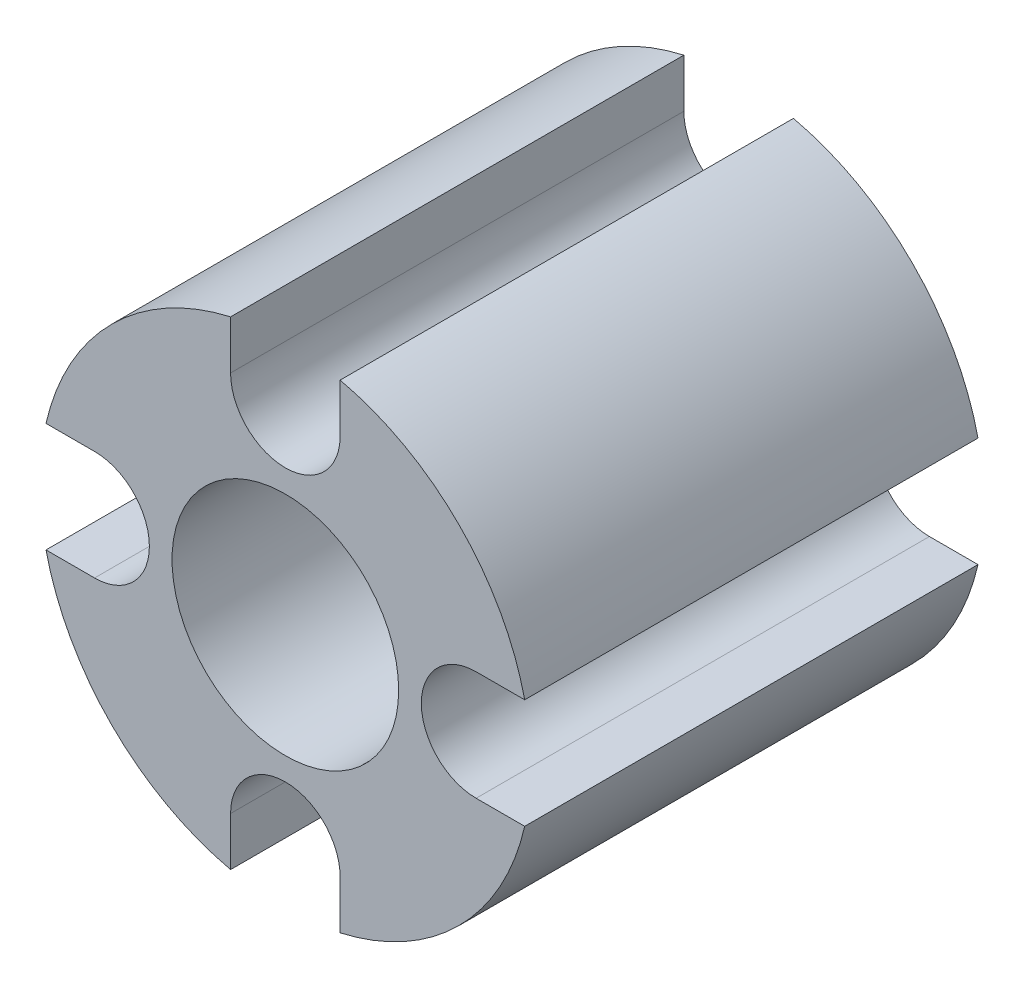
ISO-10303-21;
HEADER;
FILE_DESCRIPTION(('STEP AP214'),'2;1');
FILE_NAME('part.step','',(''),(''),'','','');
FILE_SCHEMA(('AUTOMOTIVE_DESIGN { 1 0 10303 214 1 1 1 1 }'));
ENDSEC;
DATA;
#1=APPLICATION_CONTEXT('core data for automotive mechanical design processes');
#2=APPLICATION_PROTOCOL_DEFINITION('international standard','automotive_design',2000,#1);
#3=PRODUCT_CONTEXT('',#1,'mechanical');
#4=PRODUCT('Part','Part','',(#3));
#5=PRODUCT_RELATED_PRODUCT_CATEGORY('part','',(#4));
#6=PRODUCT_DEFINITION_FORMATION('','',#4);
#7=PRODUCT_DEFINITION_CONTEXT('part definition',#1,'design');
#8=PRODUCT_DEFINITION('design','',#6,#7);
#9=PRODUCT_DEFINITION_SHAPE('','',#8);
#10=(LENGTH_UNIT() NAMED_UNIT(*) SI_UNIT(.MILLI.,.METRE.));
#11=(NAMED_UNIT(*) PLANE_ANGLE_UNIT() SI_UNIT($,.RADIAN.));
#12=(NAMED_UNIT(*) SI_UNIT($,.STERADIAN.) SOLID_ANGLE_UNIT());
#13=UNCERTAINTY_MEASURE_WITH_UNIT(LENGTH_MEASURE(1.E-05),#10,'distance_accuracy_value','');
#14=(GEOMETRIC_REPRESENTATION_CONTEXT(3) GLOBAL_UNCERTAINTY_ASSIGNED_CONTEXT((#13)) GLOBAL_UNIT_ASSIGNED_CONTEXT((#10,
#11,#12)) REPRESENTATION_CONTEXT('',''));
#15=CARTESIAN_POINT('',(0.,0.,0.));
#16=DIRECTION('',(0.,0.,1.));
#17=DIRECTION('',(1.,0.,0.));
#18=AXIS2_PLACEMENT_3D('',#15,#16,#17);
#19=CARTESIAN_POINT('',(0.,2.525,6.));
#20=DIRECTION('',(0.,0.,1.));
#21=DIRECTION('',(1.,0.,0.));
#22=AXIS2_PLACEMENT_3D('',#19,#20,#21);
#23=PLANE('',#22);
#24=CARTESIAN_POINT('',(0.,2.525,6.));
#25=DIRECTION('',(0.,0.,-1.));
#26=DIRECTION('',(1.,0.,0.));
#27=AXIS2_PLACEMENT_3D('',#24,#25,#26);
#28=CIRCLE('',#27,0.725);
#29=CARTESIAN_POINT('',(0.725,2.525,6.));
#30=VERTEX_POINT('',#29);
#31=CARTESIAN_POINT('',(-0.725,2.525,6.));
#32=VERTEX_POINT('',#31);
#33=EDGE_CURVE('E209',#30,#32,#28,.T.);
#34=ORIENTED_EDGE('',*,*,#33,.T.);
#35=DIRECTION('',(0.,1.,0.));
#36=VECTOR('',#35,1.);
#37=CARTESIAN_POINT('',(-0.725,2.525,6.));
#38=LINE('',#37,#36);
#39=CARTESIAN_POINT('',(-0.724999999999996,3.16810274454598,6.));
#40=VERTEX_POINT('',#39);
#41=EDGE_CURVE('E117',#32,#40,#38,.T.);
#42=ORIENTED_EDGE('',*,*,#41,.T.);
#43=CARTESIAN_POINT('',(0.,0.,6.));
#44=DIRECTION('',(0.,0.,1.));
#45=DIRECTION('',(1.,0.,0.));
#46=AXIS2_PLACEMENT_3D('',#43,#44,#45);
#47=CIRCLE('',#46,3.24999999999997);
#48=CARTESIAN_POINT('',(-3.16810274454595,0.724999999999984,6.));
#49=VERTEX_POINT('',#48);
#50=EDGE_CURVE('E248',#40,#49,#47,.T.);
#51=ORIENTED_EDGE('',*,*,#50,.T.);
#52=DIRECTION('',(1.,0.,0.));
#53=VECTOR('',#52,1.);
#54=CARTESIAN_POINT('',(-2.525,0.724999999999996,6.));
#55=LINE('',#54,#53);
#56=CARTESIAN_POINT('',(-2.525,0.725,6.));
#57=VERTEX_POINT('',#56);
#58=EDGE_CURVE('E267',#49,#57,#55,.T.);
#59=ORIENTED_EDGE('',*,*,#58,.T.);
#60=CARTESIAN_POINT('',(-2.525,0.,6.));
#61=DIRECTION('',(0.,0.,-1.));
#62=DIRECTION('',(1.,0.,0.));
#63=AXIS2_PLACEMENT_3D('',#60,#61,#62);
#64=CIRCLE('',#63,0.725);
#65=CARTESIAN_POINT('',(-2.525,-0.725000000000004,6.));
#66=VERTEX_POINT('',#65);
#67=EDGE_CURVE('E264',#57,#66,#64,.T.);
#68=ORIENTED_EDGE('',*,*,#67,.T.);
#69=DIRECTION('',(-1.,0.,0.));
#70=VECTOR('',#69,1.);
#71=CARTESIAN_POINT('',(-2.525,-0.725000000000004,6.));
#72=LINE('',#71,#70);
#73=CARTESIAN_POINT('',(-3.16810274454602,-0.724999999999966,6.));
#74=VERTEX_POINT('',#73);
#75=EDGE_CURVE('E266',#66,#74,#72,.T.);
#76=ORIENTED_EDGE('',*,*,#75,.T.);
#77=CARTESIAN_POINT('',(0.,0.,6.));
#78=DIRECTION('',(0.,0.,1.));
#79=DIRECTION('',(1.,0.,0.));
#80=AXIS2_PLACEMENT_3D('',#77,#78,#79);
#81=CIRCLE('',#80,3.25);
#82=CARTESIAN_POINT('',(-0.724999999999996,-3.16810274454602,6.));
#83=VERTEX_POINT('',#82);
#84=EDGE_CURVE('E269',#74,#83,#81,.T.);
#85=ORIENTED_EDGE('',*,*,#84,.T.);
#86=DIRECTION('',(0.,1.,0.));
#87=VECTOR('',#86,1.);
#88=CARTESIAN_POINT('',(-0.724999999999996,-2.525,6.));
#89=LINE('',#88,#87);
#90=CARTESIAN_POINT('',(-0.724999999999996,-2.525,6.));
#91=VERTEX_POINT('',#90);
#92=EDGE_CURVE('E275',#83,#91,#89,.T.);
#93=ORIENTED_EDGE('',*,*,#92,.T.);
#94=CARTESIAN_POINT('',(0.,-2.525,6.));
#95=DIRECTION('',(0.,0.,-1.));
#96=DIRECTION('',(1.,0.,0.));
#97=AXIS2_PLACEMENT_3D('',#94,#95,#96);
#98=CIRCLE('',#97,0.725);
#99=CARTESIAN_POINT('',(0.725000000000004,-2.525,6.));
#100=VERTEX_POINT('',#99);
#101=EDGE_CURVE('E277',#91,#100,#98,.T.);
#102=ORIENTED_EDGE('',*,*,#101,.T.);
#103=DIRECTION('',(0.,-1.,0.));
#104=VECTOR('',#103,1.);
#105=CARTESIAN_POINT('',(0.725000000000004,-2.525,6.));
#106=LINE('',#105,#104);
#107=CARTESIAN_POINT('',(0.725000000000004,-3.16810274454602,6.));
#108=VERTEX_POINT('',#107);
#109=EDGE_CURVE('E279',#100,#108,#106,.T.);
#110=ORIENTED_EDGE('',*,*,#109,.T.);
#111=CARTESIAN_POINT('',(0.,0.,6.));
#112=DIRECTION('',(0.,0.,1.));
#113=DIRECTION('',(1.,0.,0.));
#114=AXIS2_PLACEMENT_3D('',#111,#112,#113);
#115=CIRCLE('',#114,3.25);
#116=CARTESIAN_POINT('',(3.16810274454602,-0.724999999999996,6.));
#117=VERTEX_POINT('',#116);
#118=EDGE_CURVE('E281',#108,#117,#115,.T.);
#119=ORIENTED_EDGE('',*,*,#118,.T.);
#120=DIRECTION('',(-1.,0.,0.));
#121=VECTOR('',#120,1.);
#122=CARTESIAN_POINT('',(2.525,-0.724999999999996,6.));
#123=LINE('',#122,#121);
#124=CARTESIAN_POINT('',(2.525,-0.724999999999996,6.));
#125=VERTEX_POINT('',#124);
#126=EDGE_CURVE('E283',#117,#125,#123,.T.);
#127=ORIENTED_EDGE('',*,*,#126,.T.);
#128=CARTESIAN_POINT('',(2.525,0.,6.));
#129=DIRECTION('',(0.,0.,-1.));
#130=DIRECTION('',(1.,0.,0.));
#131=AXIS2_PLACEMENT_3D('',#128,#129,#130);
#132=CIRCLE('',#131,0.725);
#133=CARTESIAN_POINT('',(2.525,0.725000000000003,6.));
#134=VERTEX_POINT('',#133);
#135=EDGE_CURVE('E160',#125,#134,#132,.T.);
#136=ORIENTED_EDGE('',*,*,#135,.T.);
#137=DIRECTION('',(1.,0.,0.));
#138=VECTOR('',#137,1.);
#139=CARTESIAN_POINT('',(2.525,0.725000000000003,6.));
#140=LINE('',#139,#138);
#141=CARTESIAN_POINT('',(3.16810274454601,0.725000000000004,6.));
#142=VERTEX_POINT('',#141);
#143=EDGE_CURVE('E154',#134,#142,#140,.T.);
#144=ORIENTED_EDGE('',*,*,#143,.T.);
#145=CARTESIAN_POINT('',(0.,0.,6.));
#146=DIRECTION('',(0.,0.,1.));
#147=DIRECTION('',(1.,0.,0.));
#148=AXIS2_PLACEMENT_3D('',#145,#146,#147);
#149=CIRCLE('',#148,3.25);
#150=CARTESIAN_POINT('',(0.725,3.16810274454602,6.));
#151=VERTEX_POINT('',#150);
#152=EDGE_CURVE('E158',#142,#151,#149,.T.);
#153=ORIENTED_EDGE('',*,*,#152,.T.);
#154=DIRECTION('',(0.,-1.,0.));
#155=VECTOR('',#154,1.);
#156=CARTESIAN_POINT('',(0.725,2.525,6.));
#157=LINE('',#156,#155);
#158=EDGE_CURVE('E50',#151,#30,#157,.T.);
#159=ORIENTED_EDGE('',*,*,#158,.T.);
#160=EDGE_LOOP('',(#34,#42,#51,#59,#68,#76,#85,#93,#102,#110,#119,#127,#136,#144,#153,#159));
#161=FACE_BOUND('',#160,.T.);
#162=CARTESIAN_POINT('',(0.,0.,6.));
#163=DIRECTION('',(0.,0.,1.));
#164=DIRECTION('',(1.,0.,0.));
#165=AXIS2_PLACEMENT_3D('',#162,#163,#164);
#166=CIRCLE('',#165,1.5);
#167=CARTESIAN_POINT('',(1.5,0.,6.));
#168=VERTEX_POINT('',#167);
#169=EDGE_CURVE('E182',#168,#168,#166,.T.);
#170=ORIENTED_EDGE('',*,*,#169,.F.);
#171=EDGE_LOOP('',(#170));
#172=FACE_BOUND('',#171,.T.);
#173=ADVANCED_FACE('F33',(#161,#172),#23,.T.);
#174=CARTESIAN_POINT('',(0.,2.525,0.));
#175=DIRECTION('',(0.,0.,1.));
#176=DIRECTION('',(1.,0.,0.));
#177=AXIS2_PLACEMENT_3D('',#174,#175,#176);
#178=PLANE('',#177);
#179=CARTESIAN_POINT('',(0.,2.525,0.));
#180=DIRECTION('',(0.,0.,-1.));
#181=DIRECTION('',(1.,0.,0.));
#182=AXIS2_PLACEMENT_3D('',#179,#180,#181);
#183=CIRCLE('',#182,0.725);
#184=CARTESIAN_POINT('',(0.725,2.525,0.));
#185=VERTEX_POINT('',#184);
#186=CARTESIAN_POINT('',(-0.725,2.525,0.));
#187=VERTEX_POINT('',#186);
#188=EDGE_CURVE('E178',#185,#187,#183,.T.);
#189=ORIENTED_EDGE('',*,*,#188,.F.);
#190=DIRECTION('',(0.,-1.,0.));
#191=VECTOR('',#190,1.);
#192=CARTESIAN_POINT('',(0.725,2.525,0.));
#193=LINE('',#192,#191);
#194=CARTESIAN_POINT('',(0.725,3.16810274454602,0.));
#195=VERTEX_POINT('',#194);
#196=EDGE_CURVE('E109',#195,#185,#193,.T.);
#197=ORIENTED_EDGE('',*,*,#196,.F.);
#198=CARTESIAN_POINT('',(0.,0.,0.));
#199=DIRECTION('',(0.,0.,1.));
#200=DIRECTION('',(1.,0.,0.));
#201=AXIS2_PLACEMENT_3D('',#198,#199,#200);
#202=CIRCLE('',#201,3.25);
#203=CARTESIAN_POINT('',(3.16810274454601,0.725000000000004,0.));
#204=VERTEX_POINT('',#203);
#205=EDGE_CURVE('E103',#204,#195,#202,.T.);
#206=ORIENTED_EDGE('',*,*,#205,.F.);
#207=DIRECTION('',(1.,0.,0.));
#208=VECTOR('',#207,1.);
#209=CARTESIAN_POINT('',(2.525,0.725000000000003,0.));
#210=LINE('',#209,#208);
#211=CARTESIAN_POINT('',(2.525,0.725000000000003,0.));
#212=VERTEX_POINT('',#211);
#213=EDGE_CURVE('E168',#212,#204,#210,.T.);
#214=ORIENTED_EDGE('',*,*,#213,.F.);
#215=CARTESIAN_POINT('',(2.525,0.,0.));
#216=DIRECTION('',(0.,0.,-1.));
#217=DIRECTION('',(1.,0.,0.));
#218=AXIS2_PLACEMENT_3D('',#215,#216,#217);
#219=CIRCLE('',#218,0.725);
#220=CARTESIAN_POINT('',(2.525,-0.724999999999996,0.));
#221=VERTEX_POINT('',#220);
#222=EDGE_CURVE('E204',#221,#212,#219,.T.);
#223=ORIENTED_EDGE('',*,*,#222,.F.);
#224=DIRECTION('',(-1.,0.,0.));
#225=VECTOR('',#224,1.);
#226=CARTESIAN_POINT('',(2.525,-0.724999999999996,0.));
#227=LINE('',#226,#225);
#228=CARTESIAN_POINT('',(3.16810274454602,-0.724999999999996,0.));
#229=VERTEX_POINT('',#228);
#230=EDGE_CURVE('E202',#229,#221,#227,.T.);
#231=ORIENTED_EDGE('',*,*,#230,.F.);
#232=CARTESIAN_POINT('',(0.,0.,0.));
#233=DIRECTION('',(0.,0.,1.));
#234=DIRECTION('',(1.,0.,0.));
#235=AXIS2_PLACEMENT_3D('',#232,#233,#234);
#236=CIRCLE('',#235,3.25);
#237=CARTESIAN_POINT('',(0.725000000000004,-3.16810274454602,0.));
#238=VERTEX_POINT('',#237);
#239=EDGE_CURVE('E200',#238,#229,#236,.T.);
#240=ORIENTED_EDGE('',*,*,#239,.F.);
#241=DIRECTION('',(0.,-1.,0.));
#242=VECTOR('',#241,1.);
#243=CARTESIAN_POINT('',(0.725000000000004,-2.525,0.));
#244=LINE('',#243,#242);
#245=CARTESIAN_POINT('',(0.725000000000004,-2.525,0.));
#246=VERTEX_POINT('',#245);
#247=EDGE_CURVE('E198',#246,#238,#244,.T.);
#248=ORIENTED_EDGE('',*,*,#247,.F.);
#249=CARTESIAN_POINT('',(0.,-2.525,0.));
#250=DIRECTION('',(0.,0.,-1.));
#251=DIRECTION('',(1.,0.,0.));
#252=AXIS2_PLACEMENT_3D('',#249,#250,#251);
#253=CIRCLE('',#252,0.725);
#254=CARTESIAN_POINT('',(-0.724999999999996,-2.525,0.));
#255=VERTEX_POINT('',#254);
#256=EDGE_CURVE('E196',#255,#246,#253,.T.);
#257=ORIENTED_EDGE('',*,*,#256,.F.);
#258=DIRECTION('',(0.,1.,0.));
#259=VECTOR('',#258,1.);
#260=CARTESIAN_POINT('',(-0.724999999999996,-2.525,0.));
#261=LINE('',#260,#259);
#262=CARTESIAN_POINT('',(-0.724999999999996,-3.16810274454602,0.));
#263=VERTEX_POINT('',#262);
#264=EDGE_CURVE('E194',#263,#255,#261,.T.);
#265=ORIENTED_EDGE('',*,*,#264,.F.);
#266=CARTESIAN_POINT('',(0.,0.,0.));
#267=DIRECTION('',(0.,0.,1.));
#268=DIRECTION('',(1.,0.,0.));
#269=AXIS2_PLACEMENT_3D('',#266,#267,#268);
#270=CIRCLE('',#269,3.25);
#271=CARTESIAN_POINT('',(-3.16810274454602,-0.724999999999966,0.));
#272=VERTEX_POINT('',#271);
#273=EDGE_CURVE('E192',#272,#263,#270,.T.);
#274=ORIENTED_EDGE('',*,*,#273,.F.);
#275=DIRECTION('',(-1.,0.,0.));
#276=VECTOR('',#275,1.);
#277=CARTESIAN_POINT('',(-2.525,-0.725000000000004,0.));
#278=LINE('',#277,#276);
#279=CARTESIAN_POINT('',(-2.525,-0.725000000000004,0.));
#280=VERTEX_POINT('',#279);
#281=EDGE_CURVE('E190',#280,#272,#278,.T.);
#282=ORIENTED_EDGE('',*,*,#281,.F.);
#283=CARTESIAN_POINT('',(-2.525,0.,0.));
#284=DIRECTION('',(0.,0.,-1.));
#285=DIRECTION('',(1.,0.,0.));
#286=AXIS2_PLACEMENT_3D('',#283,#284,#285);
#287=CIRCLE('',#286,0.725);
#288=CARTESIAN_POINT('',(-2.525,0.725,0.));
#289=VERTEX_POINT('',#288);
#290=EDGE_CURVE('E188',#289,#280,#287,.T.);
#291=ORIENTED_EDGE('',*,*,#290,.F.);
#292=DIRECTION('',(1.,0.,0.));
#293=VECTOR('',#292,1.);
#294=CARTESIAN_POINT('',(-2.525,0.724999999999996,0.));
#295=LINE('',#294,#293);
#296=CARTESIAN_POINT('',(-3.16810274454595,0.724999999999984,0.));
#297=VERTEX_POINT('',#296);
#298=EDGE_CURVE('E186',#297,#289,#295,.T.);
#299=ORIENTED_EDGE('',*,*,#298,.F.);
#300=CARTESIAN_POINT('',(0.,0.,0.));
#301=DIRECTION('',(0.,0.,1.));
#302=DIRECTION('',(1.,0.,0.));
#303=AXIS2_PLACEMENT_3D('',#300,#301,#302);
#304=CIRCLE('',#303,3.24999999999997);
#305=CARTESIAN_POINT('',(-0.724999999999996,3.16810274454598,0.));
#306=VERTEX_POINT('',#305);
#307=EDGE_CURVE('E184',#306,#297,#304,.T.);
#308=ORIENTED_EDGE('',*,*,#307,.F.);
#309=DIRECTION('',(0.,1.,0.));
#310=VECTOR('',#309,1.);
#311=CARTESIAN_POINT('',(-0.725,2.525,0.));
#312=LINE('',#311,#310);
#313=EDGE_CURVE('E181',#187,#306,#312,.T.);
#314=ORIENTED_EDGE('',*,*,#313,.F.);
#315=EDGE_LOOP('',(#189,#197,#206,#214,#223,#231,#240,#248,#257,#265,#274,#282,#291,#299,#308,#314));
#316=FACE_BOUND('',#315,.T.);
#317=CARTESIAN_POINT('',(0.,0.,0.));
#318=DIRECTION('',(0.,0.,1.));
#319=DIRECTION('',(1.,0.,0.));
#320=AXIS2_PLACEMENT_3D('',#317,#318,#319);
#321=CIRCLE('',#320,1.5);
#322=CARTESIAN_POINT('',(1.5,0.,0.));
#323=VERTEX_POINT('',#322);
#324=EDGE_CURVE('E488',#323,#323,#321,.T.);
#325=ORIENTED_EDGE('',*,*,#324,.T.);
#326=EDGE_LOOP('',(#325));
#327=FACE_BOUND('',#326,.T.);
#328=ADVANCED_FACE('F252',(#316,#327),#178,.F.);
#329=CARTESIAN_POINT('',(0.,2.525,6.));
#330=DIRECTION('',(0.,0.,-1.));
#331=DIRECTION('',(-1.,0.,0.));
#332=AXIS2_PLACEMENT_3D('',#329,#330,#331);
#333=CYLINDRICAL_SURFACE('',#332,0.725);
#334=ORIENTED_EDGE('',*,*,#188,.T.);
#335=DIRECTION('',(0.,0.,-1.));
#336=VECTOR('',#335,1.);
#337=CARTESIAN_POINT('',(-0.725,2.525,6.));
#338=LINE('',#337,#336);
#339=EDGE_CURVE('E11',#32,#187,#338,.T.);
#340=ORIENTED_EDGE('',*,*,#339,.F.);
#341=ORIENTED_EDGE('',*,*,#33,.F.);
#342=DIRECTION('',(0.,0.,-1.));
#343=VECTOR('',#342,1.);
#344=CARTESIAN_POINT('',(0.725,2.525,6.));
#345=LINE('',#344,#343);
#346=EDGE_CURVE('E174',#30,#185,#345,.T.);
#347=ORIENTED_EDGE('',*,*,#346,.T.);
#348=EDGE_LOOP('',(#334,#340,#341,#347));
#349=FACE_BOUND('',#348,.T.);
#350=ADVANCED_FACE('F35',(#349),#333,.F.);
#351=CARTESIAN_POINT('',(-0.725,2.525,6.));
#352=DIRECTION('',(-1.,0.,0.));
#353=DIRECTION('',(0.,-1.,0.));
#354=AXIS2_PLACEMENT_3D('',#351,#352,#353);
#355=PLANE('',#354);
#356=ORIENTED_EDGE('',*,*,#313,.T.);
#357=DIRECTION('',(0.,0.,-1.));
#358=VECTOR('',#357,1.);
#359=CARTESIAN_POINT('',(-0.724999999999996,3.16810274454598,6.));
#360=LINE('',#359,#358);
#361=EDGE_CURVE('E42',#40,#306,#360,.T.);
#362=ORIENTED_EDGE('',*,*,#361,.F.);
#363=ORIENTED_EDGE('',*,*,#41,.F.);
#364=ORIENTED_EDGE('',*,*,#339,.T.);
#365=EDGE_LOOP('',(#356,#362,#363,#364));
#366=FACE_BOUND('',#365,.T.);
#367=ADVANCED_FACE('F317',(#366),#355,.F.);
#368=CARTESIAN_POINT('',(0.,0.,6.));
#369=DIRECTION('',(0.,0.,-1.));
#370=DIRECTION('',(-1.,0.,0.));
#371=AXIS2_PLACEMENT_3D('',#368,#369,#370);
#372=CYLINDRICAL_SURFACE('',#371,3.24999999999997);
#373=ORIENTED_EDGE('',*,*,#307,.T.);
#374=DIRECTION('',(0.,0.,-1.));
#375=VECTOR('',#374,1.);
#376=CARTESIAN_POINT('',(-3.16810274454595,0.724999999999984,6.));
#377=LINE('',#376,#375);
#378=EDGE_CURVE('E240',#49,#297,#377,.T.);
#379=ORIENTED_EDGE('',*,*,#378,.F.);
#380=ORIENTED_EDGE('',*,*,#50,.F.);
#381=ORIENTED_EDGE('',*,*,#361,.T.);
#382=EDGE_LOOP('',(#373,#379,#380,#381));
#383=FACE_BOUND('',#382,.T.);
#384=ADVANCED_FACE('F246',(#383),#372,.T.);
#385=CARTESIAN_POINT('',(-2.525,0.724999999999996,6.));
#386=DIRECTION('',(0.,1.,0.));
#387=DIRECTION('',(-1.,0.,0.));
#388=AXIS2_PLACEMENT_3D('',#385,#386,#387);
#389=PLANE('',#388);
#390=ORIENTED_EDGE('',*,*,#298,.T.);
#391=DIRECTION('',(0.,0.,-1.));
#392=VECTOR('',#391,1.);
#393=CARTESIAN_POINT('',(-2.525,0.725,6.));
#394=LINE('',#393,#392);
#395=EDGE_CURVE('E237',#57,#289,#394,.T.);
#396=ORIENTED_EDGE('',*,*,#395,.F.);
#397=ORIENTED_EDGE('',*,*,#58,.F.);
#398=ORIENTED_EDGE('',*,*,#378,.T.);
#399=EDGE_LOOP('',(#390,#396,#397,#398));
#400=FACE_BOUND('',#399,.T.);
#401=ADVANCED_FACE('F258',(#400),#389,.F.);
#402=CARTESIAN_POINT('',(-2.525,0.,6.));
#403=DIRECTION('',(0.,0.,-1.));
#404=DIRECTION('',(-1.,0.,0.));
#405=AXIS2_PLACEMENT_3D('',#402,#403,#404);
#406=CYLINDRICAL_SURFACE('',#405,0.725);
#407=ORIENTED_EDGE('',*,*,#290,.T.);
#408=DIRECTION('',(0.,0.,-1.));
#409=VECTOR('',#408,1.);
#410=CARTESIAN_POINT('',(-2.525,-0.725000000000004,6.));
#411=LINE('',#410,#409);
#412=EDGE_CURVE('E234',#66,#280,#411,.T.);
#413=ORIENTED_EDGE('',*,*,#412,.F.);
#414=ORIENTED_EDGE('',*,*,#67,.F.);
#415=ORIENTED_EDGE('',*,*,#395,.T.);
#416=EDGE_LOOP('',(#407,#413,#414,#415));
#417=FACE_BOUND('',#416,.T.);
#418=ADVANCED_FACE('F262',(#417),#406,.F.);
#419=CARTESIAN_POINT('',(-2.525,-0.725000000000004,6.));
#420=DIRECTION('',(0.,-1.,0.));
#421=DIRECTION('',(1.,0.,0.));
#422=AXIS2_PLACEMENT_3D('',#419,#420,#421);
#423=PLANE('',#422);
#424=ORIENTED_EDGE('',*,*,#281,.T.);
#425=DIRECTION('',(0.,0.,-1.));
#426=VECTOR('',#425,1.);
#427=CARTESIAN_POINT('',(-3.16810274454602,-0.724999999999966,6.));
#428=LINE('',#427,#426);
#429=EDGE_CURVE('E231',#74,#272,#428,.T.);
#430=ORIENTED_EDGE('',*,*,#429,.F.);
#431=ORIENTED_EDGE('',*,*,#75,.F.);
#432=ORIENTED_EDGE('',*,*,#412,.T.);
#433=EDGE_LOOP('',(#424,#430,#431,#432));
#434=FACE_BOUND('',#433,.T.);
#435=ADVANCED_FACE('F330',(#434),#423,.F.);
#436=CARTESIAN_POINT('',(0.,0.,6.));
#437=DIRECTION('',(0.,0.,-1.));
#438=DIRECTION('',(-1.,0.,0.));
#439=AXIS2_PLACEMENT_3D('',#436,#437,#438);
#440=CYLINDRICAL_SURFACE('',#439,3.25);
#441=ORIENTED_EDGE('',*,*,#273,.T.);
#442=DIRECTION('',(0.,0.,-1.));
#443=VECTOR('',#442,1.);
#444=CARTESIAN_POINT('',(-0.724999999999996,-3.16810274454602,6.));
#445=LINE('',#444,#443);
#446=EDGE_CURVE('E228',#83,#263,#445,.T.);
#447=ORIENTED_EDGE('',*,*,#446,.F.);
#448=ORIENTED_EDGE('',*,*,#84,.F.);
#449=ORIENTED_EDGE('',*,*,#429,.T.);
#450=EDGE_LOOP('',(#441,#447,#448,#449));
#451=FACE_BOUND('',#450,.T.);
#452=ADVANCED_FACE('F333',(#451),#440,.T.);
#453=CARTESIAN_POINT('',(-0.724999999999996,-2.525,6.));
#454=DIRECTION('',(-1.,0.,0.));
#455=DIRECTION('',(0.,-1.,0.));
#456=AXIS2_PLACEMENT_3D('',#453,#454,#455);
#457=PLANE('',#456);
#458=ORIENTED_EDGE('',*,*,#264,.T.);
#459=DIRECTION('',(0.,0.,-1.));
#460=VECTOR('',#459,1.);
#461=CARTESIAN_POINT('',(-0.724999999999996,-2.525,6.));
#462=LINE('',#461,#460);
#463=EDGE_CURVE('E225',#91,#255,#462,.T.);
#464=ORIENTED_EDGE('',*,*,#463,.F.);
#465=ORIENTED_EDGE('',*,*,#92,.F.);
#466=ORIENTED_EDGE('',*,*,#446,.T.);
#467=EDGE_LOOP('',(#458,#464,#465,#466));
#468=FACE_BOUND('',#467,.T.);
#469=ADVANCED_FACE('F337',(#468),#457,.F.);
#470=CARTESIAN_POINT('',(0.,-2.525,6.));
#471=DIRECTION('',(0.,0.,-1.));
#472=DIRECTION('',(-1.,0.,0.));
#473=AXIS2_PLACEMENT_3D('',#470,#471,#472);
#474=CYLINDRICAL_SURFACE('',#473,0.725);
#475=ORIENTED_EDGE('',*,*,#256,.T.);
#476=DIRECTION('',(0.,0.,-1.));
#477=VECTOR('',#476,1.);
#478=CARTESIAN_POINT('',(0.725000000000004,-2.525,6.));
#479=LINE('',#478,#477);
#480=EDGE_CURVE('E222',#100,#246,#479,.T.);
#481=ORIENTED_EDGE('',*,*,#480,.F.);
#482=ORIENTED_EDGE('',*,*,#101,.F.);
#483=ORIENTED_EDGE('',*,*,#463,.T.);
#484=EDGE_LOOP('',(#475,#481,#482,#483));
#485=FACE_BOUND('',#484,.T.);
#486=ADVANCED_FACE('F341',(#485),#474,.F.);
#487=CARTESIAN_POINT('',(0.725000000000004,-2.525,6.));
#488=DIRECTION('',(1.,0.,0.));
#489=DIRECTION('',(0.,1.,0.));
#490=AXIS2_PLACEMENT_3D('',#487,#488,#489);
#491=PLANE('',#490);
#492=ORIENTED_EDGE('',*,*,#247,.T.);
#493=DIRECTION('',(0.,0.,-1.));
#494=VECTOR('',#493,1.);
#495=CARTESIAN_POINT('',(0.725000000000004,-3.16810274454602,6.));
#496=LINE('',#495,#494);
#497=EDGE_CURVE('E219',#108,#238,#496,.T.);
#498=ORIENTED_EDGE('',*,*,#497,.F.);
#499=ORIENTED_EDGE('',*,*,#109,.F.);
#500=ORIENTED_EDGE('',*,*,#480,.T.);
#501=EDGE_LOOP('',(#492,#498,#499,#500));
#502=FACE_BOUND('',#501,.T.);
#503=ADVANCED_FACE('F345',(#502),#491,.F.);
#504=CARTESIAN_POINT('',(0.,0.,6.));
#505=DIRECTION('',(0.,0.,-1.));
#506=DIRECTION('',(-1.,0.,0.));
#507=AXIS2_PLACEMENT_3D('',#504,#505,#506);
#508=CYLINDRICAL_SURFACE('',#507,3.25);
#509=ORIENTED_EDGE('',*,*,#239,.T.);
#510=DIRECTION('',(0.,0.,-1.));
#511=VECTOR('',#510,1.);
#512=CARTESIAN_POINT('',(3.16810274454602,-0.724999999999996,6.));
#513=LINE('',#512,#511);
#514=EDGE_CURVE('E216',#117,#229,#513,.T.);
#515=ORIENTED_EDGE('',*,*,#514,.F.);
#516=ORIENTED_EDGE('',*,*,#118,.F.);
#517=ORIENTED_EDGE('',*,*,#497,.T.);
#518=EDGE_LOOP('',(#509,#515,#516,#517));
#519=FACE_BOUND('',#518,.T.);
#520=ADVANCED_FACE('F349',(#519),#508,.T.);
#521=CARTESIAN_POINT('',(2.525,-0.724999999999996,6.));
#522=DIRECTION('',(0.,-1.,0.));
#523=DIRECTION('',(1.,0.,0.));
#524=AXIS2_PLACEMENT_3D('',#521,#522,#523);
#525=PLANE('',#524);
#526=ORIENTED_EDGE('',*,*,#230,.T.);
#527=DIRECTION('',(0.,0.,-1.));
#528=VECTOR('',#527,1.);
#529=CARTESIAN_POINT('',(2.525,-0.724999999999996,6.));
#530=LINE('',#529,#528);
#531=EDGE_CURVE('E213',#125,#221,#530,.T.);
#532=ORIENTED_EDGE('',*,*,#531,.F.);
#533=ORIENTED_EDGE('',*,*,#126,.F.);
#534=ORIENTED_EDGE('',*,*,#514,.T.);
#535=EDGE_LOOP('',(#526,#532,#533,#534));
#536=FACE_BOUND('',#535,.T.);
#537=ADVANCED_FACE('F289',(#536),#525,.F.);
#538=CARTESIAN_POINT('',(2.525,0.,6.));
#539=DIRECTION('',(0.,0.,-1.));
#540=DIRECTION('',(-1.,0.,0.));
#541=AXIS2_PLACEMENT_3D('',#538,#539,#540);
#542=CYLINDRICAL_SURFACE('',#541,0.725);
#543=ORIENTED_EDGE('',*,*,#222,.T.);
#544=DIRECTION('',(0.,0.,-1.));
#545=VECTOR('',#544,1.);
#546=CARTESIAN_POINT('',(2.525,0.725000000000003,6.));
#547=LINE('',#546,#545);
#548=EDGE_CURVE('E169',#134,#212,#547,.T.);
#549=ORIENTED_EDGE('',*,*,#548,.F.);
#550=ORIENTED_EDGE('',*,*,#135,.F.);
#551=ORIENTED_EDGE('',*,*,#531,.T.);
#552=EDGE_LOOP('',(#543,#549,#550,#551));
#553=FACE_BOUND('',#552,.T.);
#554=ADVANCED_FACE('F293',(#553),#542,.F.);
#555=CARTESIAN_POINT('',(2.525,0.725000000000003,6.));
#556=DIRECTION('',(0.,1.,0.));
#557=DIRECTION('',(-1.,0.,0.));
#558=AXIS2_PLACEMENT_3D('',#555,#556,#557);
#559=PLANE('',#558);
#560=ORIENTED_EDGE('',*,*,#213,.T.);
#561=DIRECTION('',(0.,0.,-1.));
#562=VECTOR('',#561,1.);
#563=CARTESIAN_POINT('',(3.16810274454601,0.725000000000004,6.));
#564=LINE('',#563,#562);
#565=EDGE_CURVE('E165',#142,#204,#564,.T.);
#566=ORIENTED_EDGE('',*,*,#565,.F.);
#567=ORIENTED_EDGE('',*,*,#143,.F.);
#568=ORIENTED_EDGE('',*,*,#548,.T.);
#569=EDGE_LOOP('',(#560,#566,#567,#568));
#570=FACE_BOUND('',#569,.T.);
#571=ADVANCED_FACE('F166',(#570),#559,.F.);
#572=CARTESIAN_POINT('',(0.,0.,6.));
#573=DIRECTION('',(0.,0.,-1.));
#574=DIRECTION('',(-1.,0.,0.));
#575=AXIS2_PLACEMENT_3D('',#572,#573,#574);
#576=CYLINDRICAL_SURFACE('',#575,3.25);
#577=ORIENTED_EDGE('',*,*,#205,.T.);
#578=DIRECTION('',(0.,0.,-1.));
#579=VECTOR('',#578,1.);
#580=CARTESIAN_POINT('',(0.725,3.16810274454602,6.));
#581=LINE('',#580,#579);
#582=EDGE_CURVE('E170',#151,#195,#581,.T.);
#583=ORIENTED_EDGE('',*,*,#582,.F.);
#584=ORIENTED_EDGE('',*,*,#152,.F.);
#585=ORIENTED_EDGE('',*,*,#565,.T.);
#586=EDGE_LOOP('',(#577,#583,#584,#585));
#587=FACE_BOUND('',#586,.T.);
#588=ADVANCED_FACE('F172',(#587),#576,.T.);
#589=CARTESIAN_POINT('',(0.725,2.525,6.));
#590=DIRECTION('',(1.,0.,0.));
#591=DIRECTION('',(0.,1.,0.));
#592=AXIS2_PLACEMENT_3D('',#589,#590,#591);
#593=PLANE('',#592);
#594=ORIENTED_EDGE('',*,*,#196,.T.);
#595=ORIENTED_EDGE('',*,*,#346,.F.);
#596=ORIENTED_EDGE('',*,*,#158,.F.);
#597=ORIENTED_EDGE('',*,*,#582,.T.);
#598=EDGE_LOOP('',(#594,#595,#596,#597));
#599=FACE_BOUND('',#598,.T.);
#600=ADVANCED_FACE('F297',(#599),#593,.F.);
#601=CARTESIAN_POINT('',(0.,0.,6.));
#602=DIRECTION('',(0.,0.,-1.));
#603=DIRECTION('',(-1.,0.,0.));
#604=AXIS2_PLACEMENT_3D('',#601,#602,#603);
#605=CYLINDRICAL_SURFACE('',#604,1.5);
#606=ORIENTED_EDGE('',*,*,#169,.T.);
#607=EDGE_LOOP('',(#606));
#608=FACE_BOUND('',#607,.T.);
#609=ORIENTED_EDGE('',*,*,#324,.F.);
#610=EDGE_LOOP('',(#609));
#611=FACE_BOUND('',#610,.T.);
#612=ADVANCED_FACE('F299',(#608,#611),#605,.F.);
#613=CLOSED_SHELL('',(#173,#328,#350,#367,#384,#401,#418,#435,#452,#469,#486,#503,#520,#537,
#554,#571,#588,#600,#612));
#614=MANIFOLD_SOLID_BREP('B2',#613);
#615=ADVANCED_BREP_SHAPE_REPRESENTATION('',(#18,#614),#14);
#616=SHAPE_DEFINITION_REPRESENTATION(#9,#615);
ENDSEC;
END-ISO-10303-21;
